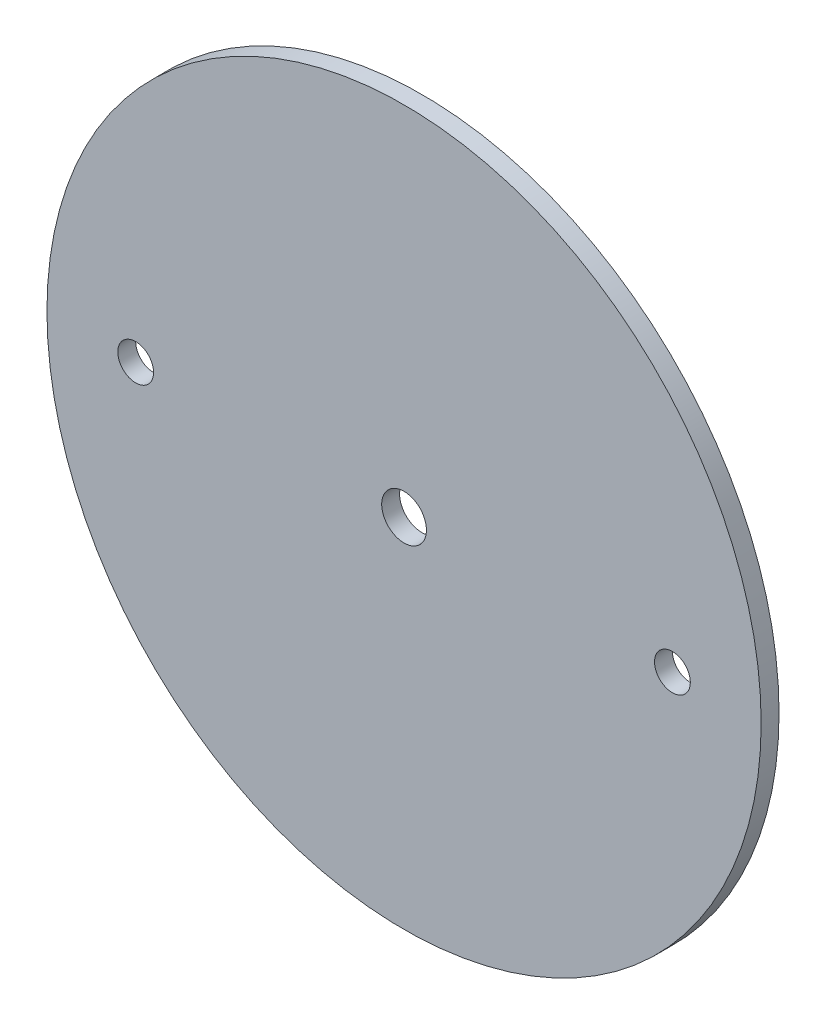
ISO-10303-21;
HEADER;
FILE_DESCRIPTION(('STEP AP214'),'2;1');
FILE_NAME('part.step','',(''),(''),'','','');
FILE_SCHEMA(('AUTOMOTIVE_DESIGN { 1 0 10303 214 1 1 1 1 }'));
ENDSEC;
DATA;
#1=APPLICATION_CONTEXT('core data for automotive mechanical design processes');
#2=APPLICATION_PROTOCOL_DEFINITION('international standard','automotive_design',2000,#1);
#3=PRODUCT_CONTEXT('',#1,'mechanical');
#4=PRODUCT('Part','Part','',(#3));
#5=PRODUCT_RELATED_PRODUCT_CATEGORY('part','',(#4));
#6=PRODUCT_DEFINITION_FORMATION('','',#4);
#7=PRODUCT_DEFINITION_CONTEXT('part definition',#1,'design');
#8=PRODUCT_DEFINITION('design','',#6,#7);
#9=PRODUCT_DEFINITION_SHAPE('','',#8);
#10=(LENGTH_UNIT() NAMED_UNIT(*) SI_UNIT(.MILLI.,.METRE.));
#11=(NAMED_UNIT(*) PLANE_ANGLE_UNIT() SI_UNIT($,.RADIAN.));
#12=(NAMED_UNIT(*) SI_UNIT($,.STERADIAN.) SOLID_ANGLE_UNIT());
#13=UNCERTAINTY_MEASURE_WITH_UNIT(LENGTH_MEASURE(1.E-05),#10,'distance_accuracy_value','');
#14=(GEOMETRIC_REPRESENTATION_CONTEXT(3) GLOBAL_UNCERTAINTY_ASSIGNED_CONTEXT((#13)) GLOBAL_UNIT_ASSIGNED_CONTEXT((#10,
#11,#12)) REPRESENTATION_CONTEXT('',''));
#15=CARTESIAN_POINT('',(0.,0.,0.));
#16=DIRECTION('',(0.,0.,1.));
#17=DIRECTION('',(1.,0.,0.));
#18=AXIS2_PLACEMENT_3D('',#15,#16,#17);
#19=CARTESIAN_POINT('',(0.,0.,1.5875));
#20=DIRECTION('',(0.,0.,-1.));
#21=DIRECTION('',(-1.,0.,0.));
#22=AXIS2_PLACEMENT_3D('',#19,#20,#21);
#23=CYLINDRICAL_SURFACE('',#22,63.373);
#24=CARTESIAN_POINT('',(0.,0.,1.5875));
#25=DIRECTION('',(0.,0.,1.));
#26=DIRECTION('',(1.,0.,0.));
#27=AXIS2_PLACEMENT_3D('',#24,#25,#26);
#28=CIRCLE('',#27,63.373);
#29=CARTESIAN_POINT('',(63.373,0.,1.5875));
#30=VERTEX_POINT('',#29);
#31=EDGE_CURVE('E10',#30,#30,#28,.T.);
#32=ORIENTED_EDGE('',*,*,#31,.F.);
#33=EDGE_LOOP('',(#32));
#34=FACE_BOUND('',#33,.T.);
#35=CARTESIAN_POINT('',(0.,0.,-1.5875));
#36=DIRECTION('',(0.,0.,1.));
#37=DIRECTION('',(1.,0.,0.));
#38=AXIS2_PLACEMENT_3D('',#35,#36,#37);
#39=CIRCLE('',#38,63.373);
#40=CARTESIAN_POINT('',(63.373,0.,-1.5875));
#41=VERTEX_POINT('',#40);
#42=EDGE_CURVE('E40',#41,#41,#39,.T.);
#43=ORIENTED_EDGE('',*,*,#42,.T.);
#44=EDGE_LOOP('',(#43));
#45=FACE_BOUND('',#44,.T.);
#46=ADVANCED_FACE('F37',(#34,#45),#23,.T.);
#47=CARTESIAN_POINT('',(0.,0.,1.5875));
#48=DIRECTION('',(0.,0.,1.));
#49=DIRECTION('',(1.,0.,0.));
#50=AXIS2_PLACEMENT_3D('',#47,#48,#49);
#51=PLANE('',#50);
#52=CARTESIAN_POINT('',(0.,0.,1.5875));
#53=DIRECTION('',(0.,0.,1.));
#54=DIRECTION('',(1.,0.,0.));
#55=AXIS2_PLACEMENT_3D('',#52,#53,#54);
#56=CIRCLE('',#55,3.96875);
#57=CARTESIAN_POINT('',(3.96875,0.,1.5875));
#58=VERTEX_POINT('',#57);
#59=EDGE_CURVE('E63',#58,#58,#56,.T.);
#60=ORIENTED_EDGE('',*,*,#59,.F.);
#61=EDGE_LOOP('',(#60));
#62=FACE_BOUND('',#61,.T.);
#63=CARTESIAN_POINT('',(47.625,0.,1.5875));
#64=DIRECTION('',(0.,0.,1.));
#65=DIRECTION('',(1.,0.,0.));
#66=AXIS2_PLACEMENT_3D('',#63,#64,#65);
#67=CIRCLE('',#66,3.17499999999998);
#68=CARTESIAN_POINT('',(50.8,0.,1.5875));
#69=VERTEX_POINT('',#68);
#70=EDGE_CURVE('E57',#69,#69,#67,.T.);
#71=ORIENTED_EDGE('',*,*,#70,.F.);
#72=EDGE_LOOP('',(#71));
#73=FACE_BOUND('',#72,.T.);
#74=CARTESIAN_POINT('',(-47.625,0.,1.5875));
#75=DIRECTION('',(0.,0.,1.));
#76=DIRECTION('',(1.,0.,0.));
#77=AXIS2_PLACEMENT_3D('',#74,#75,#76);
#78=CIRCLE('',#77,3.17499999999998);
#79=CARTESIAN_POINT('',(-44.45,0.,1.5875));
#80=VERTEX_POINT('',#79);
#81=EDGE_CURVE('E51',#80,#80,#78,.T.);
#82=ORIENTED_EDGE('',*,*,#81,.F.);
#83=EDGE_LOOP('',(#82));
#84=FACE_BOUND('',#83,.T.);
#85=ORIENTED_EDGE('',*,*,#31,.T.);
#86=EDGE_LOOP('',(#85));
#87=FACE_BOUND('',#86,.T.);
#88=ADVANCED_FACE('F70',(#62,#73,#84,#87),#51,.T.);
#89=CARTESIAN_POINT('',(0.,0.,-1.5875));
#90=DIRECTION('',(0.,0.,1.));
#91=DIRECTION('',(1.,0.,0.));
#92=AXIS2_PLACEMENT_3D('',#89,#90,#91);
#93=PLANE('',#92);
#94=CARTESIAN_POINT('',(0.,0.,-1.5875));
#95=DIRECTION('',(0.,0.,1.));
#96=DIRECTION('',(1.,0.,0.));
#97=AXIS2_PLACEMENT_3D('',#94,#95,#96);
#98=CIRCLE('',#97,3.96875);
#99=CARTESIAN_POINT('',(3.96875,0.,-1.5875));
#100=VERTEX_POINT('',#99);
#101=EDGE_CURVE('E60',#100,#100,#98,.T.);
#102=ORIENTED_EDGE('',*,*,#101,.T.);
#103=EDGE_LOOP('',(#102));
#104=FACE_BOUND('',#103,.T.);
#105=CARTESIAN_POINT('',(47.625,0.,-1.5875));
#106=DIRECTION('',(0.,0.,1.));
#107=DIRECTION('',(1.,0.,0.));
#108=AXIS2_PLACEMENT_3D('',#105,#106,#107);
#109=CIRCLE('',#108,3.175);
#110=CARTESIAN_POINT('',(50.8,0.,-1.5875));
#111=VERTEX_POINT('',#110);
#112=EDGE_CURVE('E54',#111,#111,#109,.T.);
#113=ORIENTED_EDGE('',*,*,#112,.T.);
#114=EDGE_LOOP('',(#113));
#115=FACE_BOUND('',#114,.T.);
#116=CARTESIAN_POINT('',(-47.625,0.,-1.5875));
#117=DIRECTION('',(0.,0.,1.));
#118=DIRECTION('',(1.,0.,0.));
#119=AXIS2_PLACEMENT_3D('',#116,#117,#118);
#120=CIRCLE('',#119,3.175);
#121=CARTESIAN_POINT('',(-44.45,0.,-1.5875));
#122=VERTEX_POINT('',#121);
#123=EDGE_CURVE('E47',#122,#122,#120,.T.);
#124=ORIENTED_EDGE('',*,*,#123,.T.);
#125=EDGE_LOOP('',(#124));
#126=FACE_BOUND('',#125,.T.);
#127=ORIENTED_EDGE('',*,*,#42,.F.);
#128=EDGE_LOOP('',(#127));
#129=FACE_BOUND('',#128,.T.);
#130=ADVANCED_FACE('F73',(#104,#115,#126,#129),#93,.F.);
#131=CARTESIAN_POINT('',(-47.625,0.,1.5875));
#132=DIRECTION('',(0.,0.,1.));
#133=DIRECTION('',(1.,0.,0.));
#134=AXIS2_PLACEMENT_3D('',#131,#132,#133);
#135=CYLINDRICAL_SURFACE('',#134,3.17499999999999);
#136=ORIENTED_EDGE('',*,*,#123,.F.);
#137=EDGE_LOOP('',(#136));
#138=FACE_BOUND('',#137,.T.);
#139=ORIENTED_EDGE('',*,*,#81,.T.);
#140=EDGE_LOOP('',(#139));
#141=FACE_BOUND('',#140,.T.);
#142=ADVANCED_FACE('F79',(#138,#141),#135,.F.);
#143=CARTESIAN_POINT('',(47.625,0.,1.5875));
#144=DIRECTION('',(0.,0.,1.));
#145=DIRECTION('',(1.,0.,0.));
#146=AXIS2_PLACEMENT_3D('',#143,#144,#145);
#147=CYLINDRICAL_SURFACE('',#146,3.17499999999999);
#148=ORIENTED_EDGE('',*,*,#112,.F.);
#149=EDGE_LOOP('',(#148));
#150=FACE_BOUND('',#149,.T.);
#151=ORIENTED_EDGE('',*,*,#70,.T.);
#152=EDGE_LOOP('',(#151));
#153=FACE_BOUND('',#152,.T.);
#154=ADVANCED_FACE('F81',(#150,#153),#147,.F.);
#155=CARTESIAN_POINT('',(0.,0.,1.5875));
#156=DIRECTION('',(0.,0.,1.));
#157=DIRECTION('',(1.,0.,0.));
#158=AXIS2_PLACEMENT_3D('',#155,#156,#157);
#159=CYLINDRICAL_SURFACE('',#158,3.96875);
#160=ORIENTED_EDGE('',*,*,#59,.T.);
#161=EDGE_LOOP('',(#160));
#162=FACE_BOUND('',#161,.T.);
#163=ORIENTED_EDGE('',*,*,#101,.F.);
#164=EDGE_LOOP('',(#163));
#165=FACE_BOUND('',#164,.T.);
#166=ADVANCED_FACE('F67',(#162,#165),#159,.F.);
#167=CLOSED_SHELL('',(#46,#88,#130,#142,#154,#166));
#168=MANIFOLD_SOLID_BREP('B2',#167);
#169=ADVANCED_BREP_SHAPE_REPRESENTATION('',(#18,#168),#14);
#170=SHAPE_DEFINITION_REPRESENTATION(#9,#169);
ENDSEC;
END-ISO-10303-21;
